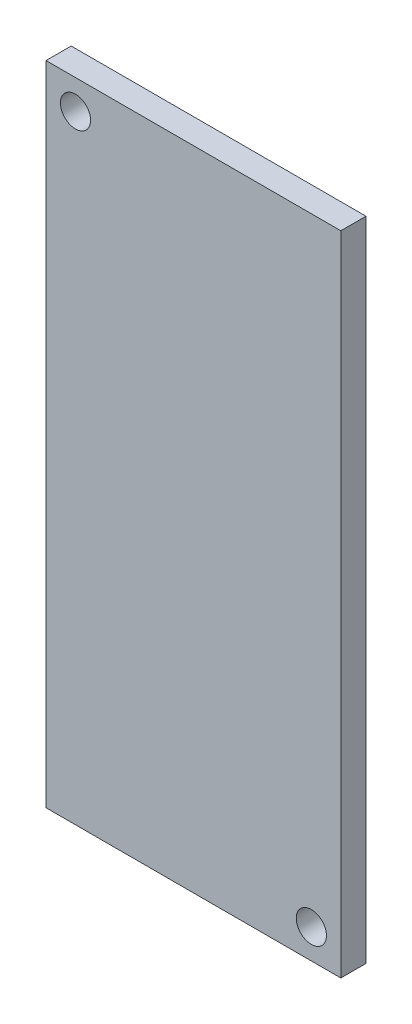
ISO-10303-21;
HEADER;
FILE_DESCRIPTION(('STEP AP214'),'2;1');
FILE_NAME('part.step','',(''),(''),'','','');
FILE_SCHEMA(('AUTOMOTIVE_DESIGN { 1 0 10303 214 1 1 1 1 }'));
ENDSEC;
DATA;
#1=APPLICATION_CONTEXT('core data for automotive mechanical design processes');
#2=APPLICATION_PROTOCOL_DEFINITION('international standard','automotive_design',2000,#1);
#3=PRODUCT_CONTEXT('',#1,'mechanical');
#4=PRODUCT('Part','Part','',(#3));
#5=PRODUCT_RELATED_PRODUCT_CATEGORY('part','',(#4));
#6=PRODUCT_DEFINITION_FORMATION('','',#4);
#7=PRODUCT_DEFINITION_CONTEXT('part definition',#1,'design');
#8=PRODUCT_DEFINITION('design','',#6,#7);
#9=PRODUCT_DEFINITION_SHAPE('','',#8);
#10=(LENGTH_UNIT() NAMED_UNIT(*) SI_UNIT(.MILLI.,.METRE.));
#11=(NAMED_UNIT(*) PLANE_ANGLE_UNIT() SI_UNIT($,.RADIAN.));
#12=(NAMED_UNIT(*) SI_UNIT($,.STERADIAN.) SOLID_ANGLE_UNIT());
#13=UNCERTAINTY_MEASURE_WITH_UNIT(LENGTH_MEASURE(1.E-05),#10,'distance_accuracy_value','');
#14=(GEOMETRIC_REPRESENTATION_CONTEXT(3) GLOBAL_UNCERTAINTY_ASSIGNED_CONTEXT((#13)) GLOBAL_UNIT_ASSIGNED_CONTEXT((#10,
#11,#12)) REPRESENTATION_CONTEXT('',''));
#15=CARTESIAN_POINT('',(0.,0.,0.));
#16=DIRECTION('',(0.,0.,1.));
#17=DIRECTION('',(1.,0.,0.));
#18=AXIS2_PLACEMENT_3D('',#15,#16,#17);
#19=CARTESIAN_POINT('',(-260.35,-571.5,0.));
#20=DIRECTION('',(0.,0.,-1.));
#21=DIRECTION('',(-1.,0.,0.));
#22=AXIS2_PLACEMENT_3D('',#19,#20,#21);
#23=PLANE('',#22);
#24=CARTESIAN_POINT('',(208.28,-519.43,0.));
#25=DIRECTION('',(0.,0.,1.));
#26=DIRECTION('',(1.,0.,0.));
#27=AXIS2_PLACEMENT_3D('',#24,#25,#26);
#28=CIRCLE('',#27,26.67);
#29=CARTESIAN_POINT('',(234.95,-519.43,0.));
#30=VERTEX_POINT('',#29);
#31=EDGE_CURVE('E84',#30,#30,#28,.F.);
#32=ORIENTED_EDGE('',*,*,#31,.F.);
#33=EDGE_LOOP('',(#32));
#34=FACE_BOUND('',#33,.T.);
#35=CARTESIAN_POINT('',(-208.28,519.43,0.));
#36=DIRECTION('',(0.,0.,1.));
#37=DIRECTION('',(1.,0.,0.));
#38=AXIS2_PLACEMENT_3D('',#35,#36,#37);
#39=CIRCLE('',#38,26.67);
#40=CARTESIAN_POINT('',(-181.61,519.43,0.));
#41=VERTEX_POINT('',#40);
#42=EDGE_CURVE('E20',#41,#41,#39,.F.);
#43=ORIENTED_EDGE('',*,*,#42,.F.);
#44=EDGE_LOOP('',(#43));
#45=FACE_BOUND('',#44,.T.);
#46=DIRECTION('',(0.,1.,0.));
#47=VECTOR('',#46,1.);
#48=CARTESIAN_POINT('',(260.35,-571.5,0.));
#49=LINE('',#48,#47);
#50=CARTESIAN_POINT('',(260.35,-571.5,0.));
#51=VERTEX_POINT('',#50);
#52=CARTESIAN_POINT('',(260.35,571.5,0.));
#53=VERTEX_POINT('',#52);
#54=EDGE_CURVE('E55',#51,#53,#49,.T.);
#55=ORIENTED_EDGE('',*,*,#54,.F.);
#56=DIRECTION('',(1.,0.,0.));
#57=VECTOR('',#56,1.);
#58=CARTESIAN_POINT('',(-260.35,-571.5,0.));
#59=LINE('',#58,#57);
#60=CARTESIAN_POINT('',(-260.35,-571.5,0.));
#61=VERTEX_POINT('',#60);
#62=EDGE_CURVE('E57',#61,#51,#59,.T.);
#63=ORIENTED_EDGE('',*,*,#62,.F.);
#64=DIRECTION('',(0.,1.,0.));
#65=VECTOR('',#64,1.);
#66=CARTESIAN_POINT('',(-260.35,-571.5,0.));
#67=LINE('',#66,#65);
#68=CARTESIAN_POINT('',(-260.35,571.5,0.));
#69=VERTEX_POINT('',#68);
#70=EDGE_CURVE('E59',#69,#61,#67,.F.);
#71=ORIENTED_EDGE('',*,*,#70,.F.);
#72=DIRECTION('',(1.,0.,0.));
#73=VECTOR('',#72,1.);
#74=CARTESIAN_POINT('',(-260.35,571.5,0.));
#75=LINE('',#74,#73);
#76=EDGE_CURVE('E95',#53,#69,#75,.F.);
#77=ORIENTED_EDGE('',*,*,#76,.F.);
#78=EDGE_LOOP('',(#55,#63,#71,#77));
#79=FACE_BOUND('',#78,.T.);
#80=ADVANCED_FACE('F16',(#34,#45,#79),#23,.T.);
#81=CARTESIAN_POINT('',(-260.35,-571.5,44.45));
#82=DIRECTION('',(-1.,0.,0.));
#83=DIRECTION('',(0.,0.,1.));
#84=AXIS2_PLACEMENT_3D('',#81,#82,#83);
#85=PLANE('',#84);
#86=DIRECTION('',(0.,1.,0.));
#87=VECTOR('',#86,1.);
#88=CARTESIAN_POINT('',(-260.35,-571.5,44.45));
#89=LINE('',#88,#87);
#90=CARTESIAN_POINT('',(-260.35,571.5,44.45));
#91=VERTEX_POINT('',#90);
#92=CARTESIAN_POINT('',(-260.35,-571.5,44.45));
#93=VERTEX_POINT('',#92);
#94=EDGE_CURVE('E86',#91,#93,#89,.F.);
#95=ORIENTED_EDGE('',*,*,#94,.F.);
#96=DIRECTION('',(0.,0.,1.));
#97=VECTOR('',#96,1.);
#98=CARTESIAN_POINT('',(-260.35,571.5,44.45));
#99=LINE('',#98,#97);
#100=EDGE_CURVE('E70',#69,#91,#99,.T.);
#101=ORIENTED_EDGE('',*,*,#100,.F.);
#102=ORIENTED_EDGE('',*,*,#70,.T.);
#103=DIRECTION('',(0.,0.,-1.));
#104=VECTOR('',#103,1.);
#105=CARTESIAN_POINT('',(-260.35,-571.5,0.));
#106=LINE('',#105,#104);
#107=EDGE_CURVE('E64',#93,#61,#106,.T.);
#108=ORIENTED_EDGE('',*,*,#107,.F.);
#109=EDGE_LOOP('',(#95,#101,#102,#108));
#110=FACE_BOUND('',#109,.T.);
#111=ADVANCED_FACE('F67',(#110),#85,.T.);
#112=CARTESIAN_POINT('',(-260.35,-571.5,0.));
#113=DIRECTION('',(0.,-1.,0.));
#114=DIRECTION('',(0.,0.,-1.));
#115=AXIS2_PLACEMENT_3D('',#112,#113,#114);
#116=PLANE('',#115);
#117=DIRECTION('',(1.,0.,0.));
#118=VECTOR('',#117,1.);
#119=CARTESIAN_POINT('',(-260.35,-571.5,44.45));
#120=LINE('',#119,#118);
#121=CARTESIAN_POINT('',(260.35,-571.5,44.45));
#122=VERTEX_POINT('',#121);
#123=EDGE_CURVE('E75',#93,#122,#120,.T.);
#124=ORIENTED_EDGE('',*,*,#123,.F.);
#125=ORIENTED_EDGE('',*,*,#107,.T.);
#126=ORIENTED_EDGE('',*,*,#62,.T.);
#127=DIRECTION('',(0.,0.,-1.));
#128=VECTOR('',#127,1.);
#129=CARTESIAN_POINT('',(260.35,-571.5,0.));
#130=LINE('',#129,#128);
#131=EDGE_CURVE('E78',#122,#51,#130,.T.);
#132=ORIENTED_EDGE('',*,*,#131,.F.);
#133=EDGE_LOOP('',(#124,#125,#126,#132));
#134=FACE_BOUND('',#133,.T.);
#135=ADVANCED_FACE('F73',(#134),#116,.T.);
#136=CARTESIAN_POINT('',(260.35,-571.5,0.));
#137=DIRECTION('',(1.,0.,0.));
#138=DIRECTION('',(0.,0.,-1.));
#139=AXIS2_PLACEMENT_3D('',#136,#137,#138);
#140=PLANE('',#139);
#141=DIRECTION('',(0.,1.,0.));
#142=VECTOR('',#141,1.);
#143=CARTESIAN_POINT('',(260.35,-571.5,44.45));
#144=LINE('',#143,#142);
#145=CARTESIAN_POINT('',(260.35,571.5,44.45));
#146=VERTEX_POINT('',#145);
#147=EDGE_CURVE('E101',#122,#146,#144,.T.);
#148=ORIENTED_EDGE('',*,*,#147,.F.);
#149=ORIENTED_EDGE('',*,*,#131,.T.);
#150=ORIENTED_EDGE('',*,*,#54,.T.);
#151=DIRECTION('',(0.,0.,1.));
#152=VECTOR('',#151,1.);
#153=CARTESIAN_POINT('',(260.35,571.5,44.45));
#154=LINE('',#153,#152);
#155=EDGE_CURVE('E35',#146,#53,#154,.F.);
#156=ORIENTED_EDGE('',*,*,#155,.F.);
#157=EDGE_LOOP('',(#148,#149,#150,#156));
#158=FACE_BOUND('',#157,.T.);
#159=ADVANCED_FACE('F99',(#158),#140,.T.);
#160=CARTESIAN_POINT('',(-260.35,571.5,44.45));
#161=DIRECTION('',(0.,1.,0.));
#162=DIRECTION('',(0.,0.,1.));
#163=AXIS2_PLACEMENT_3D('',#160,#161,#162);
#164=PLANE('',#163);
#165=DIRECTION('',(1.,0.,0.));
#166=VECTOR('',#165,1.);
#167=CARTESIAN_POINT('',(-260.35,571.5,44.45));
#168=LINE('',#167,#166);
#169=EDGE_CURVE('E83',#146,#91,#168,.F.);
#170=ORIENTED_EDGE('',*,*,#169,.F.);
#171=ORIENTED_EDGE('',*,*,#155,.T.);
#172=ORIENTED_EDGE('',*,*,#76,.T.);
#173=ORIENTED_EDGE('',*,*,#100,.T.);
#174=EDGE_LOOP('',(#170,#171,#172,#173));
#175=FACE_BOUND('',#174,.T.);
#176=ADVANCED_FACE('F107',(#175),#164,.T.);
#177=CARTESIAN_POINT('',(-208.28,519.43,0.));
#178=DIRECTION('',(0.,0.,1.));
#179=DIRECTION('',(1.,0.,0.));
#180=AXIS2_PLACEMENT_3D('',#177,#178,#179);
#181=CYLINDRICAL_SURFACE('',#180,26.67);
#182=CARTESIAN_POINT('',(-208.28,519.43,44.45));
#183=DIRECTION('',(0.,0.,1.));
#184=DIRECTION('',(1.,0.,0.));
#185=AXIS2_PLACEMENT_3D('',#182,#183,#184);
#186=CIRCLE('',#185,26.67);
#187=CARTESIAN_POINT('',(-181.61,519.43,44.45));
#188=VERTEX_POINT('',#187);
#189=EDGE_CURVE('E26',#188,#188,#186,.F.);
#190=ORIENTED_EDGE('',*,*,#189,.F.);
#191=EDGE_LOOP('',(#190));
#192=FACE_BOUND('',#191,.T.);
#193=ORIENTED_EDGE('',*,*,#42,.T.);
#194=EDGE_LOOP('',(#193));
#195=FACE_BOUND('',#194,.T.);
#196=ADVANCED_FACE('F109',(#192,#195),#181,.F.);
#197=CARTESIAN_POINT('',(208.28,-519.43,0.));
#198=DIRECTION('',(0.,0.,1.));
#199=DIRECTION('',(1.,0.,0.));
#200=AXIS2_PLACEMENT_3D('',#197,#198,#199);
#201=CYLINDRICAL_SURFACE('',#200,26.67);
#202=CARTESIAN_POINT('',(208.28,-519.43,44.45));
#203=DIRECTION('',(0.,0.,1.));
#204=DIRECTION('',(1.,0.,0.));
#205=AXIS2_PLACEMENT_3D('',#202,#203,#204);
#206=CIRCLE('',#205,26.67);
#207=CARTESIAN_POINT('',(234.95,-519.43,44.45));
#208=VERTEX_POINT('',#207);
#209=EDGE_CURVE('E10',#208,#208,#206,.F.);
#210=ORIENTED_EDGE('',*,*,#209,.F.);
#211=EDGE_LOOP('',(#210));
#212=FACE_BOUND('',#211,.T.);
#213=ORIENTED_EDGE('',*,*,#31,.T.);
#214=EDGE_LOOP('',(#213));
#215=FACE_BOUND('',#214,.T.);
#216=ADVANCED_FACE('F18',(#212,#215),#201,.F.);
#217=CARTESIAN_POINT('',(-260.35,-571.5,44.45));
#218=DIRECTION('',(0.,0.,1.));
#219=DIRECTION('',(1.,0.,0.));
#220=AXIS2_PLACEMENT_3D('',#217,#218,#219);
#221=PLANE('',#220);
#222=ORIENTED_EDGE('',*,*,#209,.T.);
#223=EDGE_LOOP('',(#222));
#224=FACE_BOUND('',#223,.T.);
#225=ORIENTED_EDGE('',*,*,#189,.T.);
#226=EDGE_LOOP('',(#225));
#227=FACE_BOUND('',#226,.T.);
#228=ORIENTED_EDGE('',*,*,#147,.T.);
#229=ORIENTED_EDGE('',*,*,#169,.T.);
#230=ORIENTED_EDGE('',*,*,#94,.T.);
#231=ORIENTED_EDGE('',*,*,#123,.T.);
#232=EDGE_LOOP('',(#228,#229,#230,#231));
#233=FACE_BOUND('',#232,.T.);
#234=ADVANCED_FACE('F105',(#224,#227,#233),#221,.T.);
#235=CLOSED_SHELL('',(#80,#111,#135,#159,#176,#196,#216,#234));
#236=MANIFOLD_SOLID_BREP('B1',#235);
#237=ADVANCED_BREP_SHAPE_REPRESENTATION('',(#18,#236),#14);
#238=SHAPE_DEFINITION_REPRESENTATION(#9,#237);
ENDSEC;
END-ISO-10303-21;
